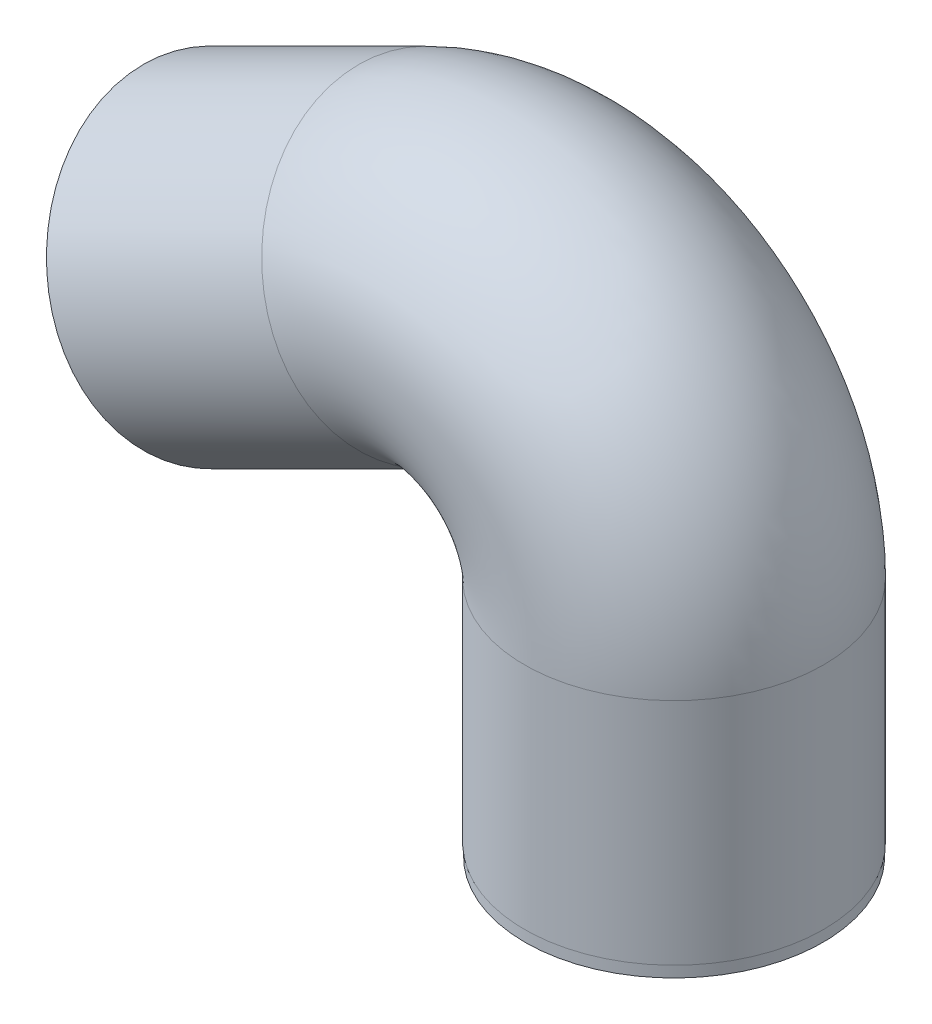
ISO-10303-21;
HEADER;
FILE_DESCRIPTION(('STEP AP214'),'2;1');
FILE_NAME('part.step','',(''),(''),'','','');
FILE_SCHEMA(('AUTOMOTIVE_DESIGN { 1 0 10303 214 1 1 1 1 }'));
ENDSEC;
DATA;
#1=APPLICATION_CONTEXT('core data for automotive mechanical design processes');
#2=APPLICATION_PROTOCOL_DEFINITION('international standard','automotive_design',2000,#1);
#3=PRODUCT_CONTEXT('',#1,'mechanical');
#4=PRODUCT('Part','Part','',(#3));
#5=PRODUCT_RELATED_PRODUCT_CATEGORY('part','',(#4));
#6=PRODUCT_DEFINITION_FORMATION('','',#4);
#7=PRODUCT_DEFINITION_CONTEXT('part definition',#1,'design');
#8=PRODUCT_DEFINITION('design','',#6,#7);
#9=PRODUCT_DEFINITION_SHAPE('','',#8);
#10=(LENGTH_UNIT() NAMED_UNIT(*) SI_UNIT(.MILLI.,.METRE.));
#11=(NAMED_UNIT(*) PLANE_ANGLE_UNIT() SI_UNIT($,.RADIAN.));
#12=(NAMED_UNIT(*) SI_UNIT($,.STERADIAN.) SOLID_ANGLE_UNIT());
#13=UNCERTAINTY_MEASURE_WITH_UNIT(LENGTH_MEASURE(1.E-05),#10,'distance_accuracy_value','');
#14=(GEOMETRIC_REPRESENTATION_CONTEXT(3) GLOBAL_UNCERTAINTY_ASSIGNED_CONTEXT((#13)) GLOBAL_UNIT_ASSIGNED_CONTEXT((#10,
#11,#12)) REPRESENTATION_CONTEXT('',''));
#15=CARTESIAN_POINT('',(0.,0.,0.));
#16=DIRECTION('',(0.,0.,1.));
#17=DIRECTION('',(1.,0.,0.));
#18=AXIS2_PLACEMENT_3D('',#15,#16,#17);
#19=CARTESIAN_POINT('',(0.,0.,0.));
#20=DIRECTION('',(0.,1.,0.));
#21=DIRECTION('',(0.,0.,1.));
#22=AXIS2_PLACEMENT_3D('',#19,#20,#21);
#23=PLANE('',#22);
#24=CARTESIAN_POINT('',(0.,0.,0.));
#25=DIRECTION('',(0.,1.,0.));
#26=DIRECTION('',(0.,0.,1.));
#27=AXIS2_PLACEMENT_3D('',#24,#25,#26);
#28=CIRCLE('',#27,13.);
#29=CARTESIAN_POINT('',(0.,0.,13.));
#30=VERTEX_POINT('',#29);
#31=EDGE_CURVE('E57',#30,#30,#28,.T.);
#32=ORIENTED_EDGE('',*,*,#31,.F.);
#33=EDGE_LOOP('',(#32));
#34=FACE_BOUND('',#33,.T.);
#35=CARTESIAN_POINT('',(0.,0.,0.));
#36=DIRECTION('',(0.,1.,0.));
#37=DIRECTION('',(0.,0.,1.));
#38=AXIS2_PLACEMENT_3D('',#35,#36,#37);
#39=CIRCLE('',#38,11.05);
#40=CARTESIAN_POINT('',(0.,0.,11.05));
#41=VERTEX_POINT('',#40);
#42=EDGE_CURVE('E66',#41,#41,#39,.T.);
#43=ORIENTED_EDGE('',*,*,#42,.T.);
#44=EDGE_LOOP('',(#43));
#45=FACE_BOUND('',#44,.T.);
#46=ADVANCED_FACE('F53',(#34,#45),#23,.F.);
#47=CARTESIAN_POINT('',(0.,1.,0.));
#48=DIRECTION('',(0.,-1.,0.));
#49=DIRECTION('',(0.,0.,-1.));
#50=AXIS2_PLACEMENT_3D('',#47,#48,#49);
#51=CYLINDRICAL_SURFACE('',#50,13.);
#52=CARTESIAN_POINT('',(0.,1.,0.));
#53=DIRECTION('',(0.,1.,0.));
#54=DIRECTION('',(0.,0.,1.));
#55=AXIS2_PLACEMENT_3D('',#52,#53,#54);
#56=CIRCLE('',#55,13.);
#57=CARTESIAN_POINT('',(0.,1.,13.));
#58=VERTEX_POINT('',#57);
#59=EDGE_CURVE('E11',#58,#58,#56,.T.);
#60=ORIENTED_EDGE('',*,*,#59,.F.);
#61=EDGE_LOOP('',(#60));
#62=FACE_BOUND('',#61,.T.);
#63=ORIENTED_EDGE('',*,*,#31,.T.);
#64=EDGE_LOOP('',(#63));
#65=FACE_BOUND('',#64,.T.);
#66=ADVANCED_FACE('F55',(#62,#65),#51,.T.);
#67=CARTESIAN_POINT('',(0.,1.,0.));
#68=DIRECTION('',(0.,-1.,0.));
#69=DIRECTION('',(0.,0.,-1.));
#70=AXIS2_PLACEMENT_3D('',#67,#68,#69);
#71=CYLINDRICAL_SURFACE('',#70,11.05);
#72=ORIENTED_EDGE('',*,*,#42,.F.);
#73=EDGE_LOOP('',(#72));
#74=FACE_BOUND('',#73,.T.);
#75=CARTESIAN_POINT('',(0.,21.,0.));
#76=DIRECTION('',(0.,-1.,0.));
#77=DIRECTION('',(1.,0.,0.));
#78=AXIS2_PLACEMENT_3D('',#75,#76,#77);
#79=CIRCLE('',#78,11.05);
#80=CARTESIAN_POINT('',(11.05,21.,0.));
#81=VERTEX_POINT('',#80);
#82=EDGE_CURVE('E95',#81,#81,#79,.T.);
#83=ORIENTED_EDGE('',*,*,#82,.F.);
#84=EDGE_LOOP('',(#83));
#85=FACE_BOUND('',#84,.T.);
#86=ADVANCED_FACE('F102',(#74,#85),#71,.F.);
#87=CARTESIAN_POINT('',(0.,1.00000000000002,0.));
#88=DIRECTION('',(0.,-1.,0.));
#89=DIRECTION('',(1.,0.,0.));
#90=AXIS2_PLACEMENT_3D('',#87,#88,#89);
#91=PLANE('',#90);
#92=ORIENTED_EDGE('',*,*,#59,.T.);
#93=EDGE_LOOP('',(#92));
#94=FACE_BOUND('',#93,.T.);
#95=CARTESIAN_POINT('',(0.,1.00000000000002,0.));
#96=DIRECTION('',(0.,-1.,0.));
#97=DIRECTION('',(1.,0.,0.));
#98=AXIS2_PLACEMENT_3D('',#95,#96,#97);
#99=CIRCLE('',#98,13.05);
#100=CARTESIAN_POINT('',(13.05,1.00000000000003,0.));
#101=VERTEX_POINT('',#100);
#102=EDGE_CURVE('E76',#101,#101,#99,.T.);
#103=ORIENTED_EDGE('',*,*,#102,.T.);
#104=EDGE_LOOP('',(#103));
#105=FACE_BOUND('',#104,.T.);
#106=ADVANCED_FACE('F104',(#94,#105),#91,.T.);
#107=CARTESIAN_POINT('',(-40.4894127082511,25.0360673666886,0.));
#108=DIRECTION('',(0.894622638699101,0.44682248637133,0.));
#109=DIRECTION('',(-0.44682248637133,0.894622638699101,0.));
#110=AXIS2_PLACEMENT_3D('',#107,#108,#109);
#111=PLANE('',#110);
#112=CARTESIAN_POINT('',(-40.4894127082511,25.0360673666886,0.));
#113=DIRECTION('',(0.894622638699101,0.44682248637133,0.));
#114=DIRECTION('',(-0.44682248637133,0.894622638699101,0.));
#115=AXIS2_PLACEMENT_3D('',#112,#113,#114);
#116=CIRCLE('',#115,11.05);
#117=CARTESIAN_POINT('',(-45.4268011826543,34.9216475243137,0.));
#118=VERTEX_POINT('',#117);
#119=EDGE_CURVE('E81',#118,#118,#116,.T.);
#120=ORIENTED_EDGE('',*,*,#119,.T.);
#121=EDGE_LOOP('',(#120));
#122=FACE_BOUND('',#121,.T.);
#123=CARTESIAN_POINT('',(-40.4894127082511,25.0360673666886,0.));
#124=DIRECTION('',(0.894622638699101,0.44682248637133,0.));
#125=DIRECTION('',(-0.44682248637133,0.894622638699101,0.));
#126=AXIS2_PLACEMENT_3D('',#123,#124,#125);
#127=CIRCLE('',#126,13.05);
#128=CARTESIAN_POINT('',(-46.3204461553969,36.7108928017119,0.));
#129=VERTEX_POINT('',#128);
#130=EDGE_CURVE('E71',#129,#129,#127,.T.);
#131=ORIENTED_EDGE('',*,*,#130,.F.);
#132=EDGE_LOOP('',(#131));
#133=FACE_BOUND('',#132,.T.);
#134=ADVANCED_FACE('F112',(#122,#133),#111,.F.);
#135=CARTESIAN_POINT('',(0.,1.00000000000002,0.));
#136=DIRECTION('',(0.,1.,0.));
#137=DIRECTION('',(0.,0.,1.));
#138=AXIS2_PLACEMENT_3D('',#135,#136,#137);
#139=CYLINDRICAL_SURFACE('',#138,13.05);
#140=CARTESIAN_POINT('',(0.,21.,0.));
#141=DIRECTION('',(0.,1.,0.));
#142=DIRECTION('',(0.,0.,1.));
#143=AXIS2_PLACEMENT_3D('',#140,#141,#142);
#144=CIRCLE('',#143,13.05);
#145=CARTESIAN_POINT('',(13.05,21.0000000000001,0.));
#146=VERTEX_POINT('',#145);
#147=EDGE_CURVE('E80',#146,#146,#144,.F.);
#148=ORIENTED_EDGE('',*,*,#147,.T.);
#149=EDGE_LOOP('',(#148));
#150=FACE_BOUND('',#149,.T.);
#151=ORIENTED_EDGE('',*,*,#102,.F.);
#152=EDGE_LOOP('',(#151));
#153=FACE_BOUND('',#152,.T.);
#154=ADVANCED_FACE('F154',(#150,#153),#139,.T.);
#155=CARTESIAN_POINT('',(-15.,21.,0.));
#156=DIRECTION('',(0.,0.,1.));
#157=DIRECTION('',(1.,0.,0.));
#158=AXIS2_PLACEMENT_3D('',#155,#156,#157);
#159=TOROIDAL_SURFACE('',#158,15.,13.05);
#160=CARTESIAN_POINT('',(-21.70233729557,34.4193395804865,0.));
#161=DIRECTION('',(0.894622638699101,0.446822486371331,0.));
#162=DIRECTION('',(-0.446822486371331,0.894622638699101,0.));
#163=AXIS2_PLACEMENT_3D('',#160,#161,#162);
#164=CIRCLE('',#163,13.05);
#165=CARTESIAN_POINT('',(-27.5333707427158,46.0941650155098,0.));
#166=VERTEX_POINT('',#165);
#167=EDGE_CURVE('E75',#166,#166,#164,.T.);
#168=CARTESIAN_POINT('',(-15.,21.,0.));
#169=DIRECTION('',(0.,0.,1.));
#170=DIRECTION('',(1.,0.,0.));
#171=AXIS2_PLACEMENT_3D('',#168,#169,#170);
#172=CIRCLE('',#171,28.05);
#173=EDGE_CURVE('',#146,#166,#172,.T.);
#174=ORIENTED_EDGE('',*,*,#147,.F.);
#175=ORIENTED_EDGE('',*,*,#167,.T.);
#176=ORIENTED_EDGE('',*,*,#173,.T.);
#177=ORIENTED_EDGE('',*,*,#173,.F.);
#178=EDGE_LOOP('',(#174,#176,#175,#177));
#179=FACE_BOUND('',#178,.T.);
#180=ADVANCED_FACE('F119',(#179),#159,.T.);
#181=CARTESIAN_POINT('',(-21.70233729557,34.4193395804865,0.));
#182=DIRECTION('',(-0.894622638699102,-0.446822486371329,0.));
#183=DIRECTION('',(0.446822486371329,-0.894622638699102,0.));
#184=AXIS2_PLACEMENT_3D('',#181,#182,#183);
#185=CYLINDRICAL_SURFACE('',#184,13.05);
#186=ORIENTED_EDGE('',*,*,#130,.T.);
#187=EDGE_LOOP('',(#186));
#188=FACE_BOUND('',#187,.T.);
#189=ORIENTED_EDGE('',*,*,#167,.F.);
#190=EDGE_LOOP('',(#189));
#191=FACE_BOUND('',#190,.T.);
#192=ADVANCED_FACE('F107',(#188,#191),#185,.T.);
#193=CARTESIAN_POINT('',(-15.,21.,0.));
#194=DIRECTION('',(0.,0.,1.));
#195=DIRECTION('',(1.,0.,0.));
#196=AXIS2_PLACEMENT_3D('',#193,#194,#195);
#197=TOROIDAL_SURFACE('',#196,15.,11.05);
#198=CARTESIAN_POINT('',(-21.70233729557,34.4193395804865,0.));
#199=DIRECTION('',(0.894622638699101,0.44682248637133,0.));
#200=DIRECTION('',(-0.44682248637133,0.894622638699101,0.));
#201=AXIS2_PLACEMENT_3D('',#198,#199,#200);
#202=CIRCLE('',#201,11.05);
#203=CARTESIAN_POINT('',(-26.6397257699732,44.3049197381116,0.));
#204=VERTEX_POINT('',#203);
#205=EDGE_CURVE('E91',#204,#204,#202,.T.);
#206=CARTESIAN_POINT('',(-15.,21.,0.));
#207=DIRECTION('',(0.,0.,1.));
#208=DIRECTION('',(1.,0.,0.));
#209=AXIS2_PLACEMENT_3D('',#206,#207,#208);
#210=CIRCLE('',#209,26.05);
#211=EDGE_CURVE('',#81,#204,#210,.T.);
#212=ORIENTED_EDGE('',*,*,#82,.T.);
#213=ORIENTED_EDGE('',*,*,#205,.F.);
#214=ORIENTED_EDGE('',*,*,#211,.T.);
#215=ORIENTED_EDGE('',*,*,#211,.F.);
#216=EDGE_LOOP('',(#212,#214,#213,#215));
#217=FACE_BOUND('',#216,.T.);
#218=ADVANCED_FACE('F100',(#217),#197,.F.);
#219=CARTESIAN_POINT('',(-21.70233729557,34.4193395804865,0.));
#220=DIRECTION('',(-0.894622638699102,-0.446822486371329,0.));
#221=DIRECTION('',(0.446822486371329,-0.894622638699102,0.));
#222=AXIS2_PLACEMENT_3D('',#219,#220,#221);
#223=CYLINDRICAL_SURFACE('',#222,11.05);
#224=ORIENTED_EDGE('',*,*,#119,.F.);
#225=EDGE_LOOP('',(#224));
#226=FACE_BOUND('',#225,.T.);
#227=ORIENTED_EDGE('',*,*,#205,.T.);
#228=EDGE_LOOP('',(#227));
#229=FACE_BOUND('',#228,.T.);
#230=ADVANCED_FACE('F114',(#226,#229),#223,.F.);
#231=CLOSED_SHELL('',(#46,#66,#86,#106,#134,#154,#180,#192,#218,#230));
#232=MANIFOLD_SOLID_BREP('B2',#231);
#233=ADVANCED_BREP_SHAPE_REPRESENTATION('',(#18,#232),#14);
#234=SHAPE_DEFINITION_REPRESENTATION(#9,#233);
ENDSEC;
END-ISO-10303-21;
